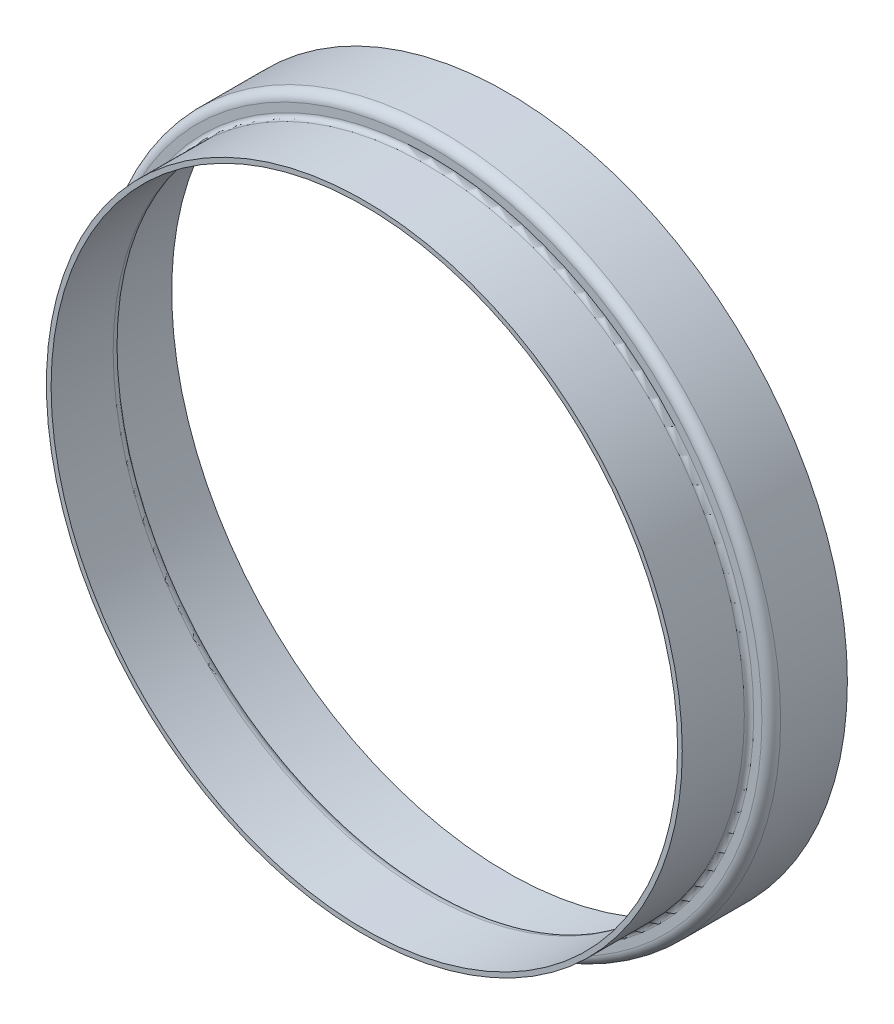
ISO-10303-21;
HEADER;
FILE_DESCRIPTION(('STEP AP214'),'2;1');
FILE_NAME('part.step','',(''),(''),'','','');
FILE_SCHEMA(('AUTOMOTIVE_DESIGN { 1 0 10303 214 1 1 1 1 }'));
ENDSEC;
DATA;
#1=APPLICATION_CONTEXT('core data for automotive mechanical design processes');
#2=APPLICATION_PROTOCOL_DEFINITION('international standard','automotive_design',2000,#1);
#3=PRODUCT_CONTEXT('',#1,'mechanical');
#4=PRODUCT('Part','Part','',(#3));
#5=PRODUCT_RELATED_PRODUCT_CATEGORY('part','',(#4));
#6=PRODUCT_DEFINITION_FORMATION('','',#4);
#7=PRODUCT_DEFINITION_CONTEXT('part definition',#1,'design');
#8=PRODUCT_DEFINITION('design','',#6,#7);
#9=PRODUCT_DEFINITION_SHAPE('','',#8);
#10=(LENGTH_UNIT() NAMED_UNIT(*) SI_UNIT(.MILLI.,.METRE.));
#11=(NAMED_UNIT(*) PLANE_ANGLE_UNIT() SI_UNIT($,.RADIAN.));
#12=(NAMED_UNIT(*) SI_UNIT($,.STERADIAN.) SOLID_ANGLE_UNIT());
#13=UNCERTAINTY_MEASURE_WITH_UNIT(LENGTH_MEASURE(1.E-05),#10,'distance_accuracy_value','');
#14=(GEOMETRIC_REPRESENTATION_CONTEXT(3) GLOBAL_UNCERTAINTY_ASSIGNED_CONTEXT((#13)) GLOBAL_UNIT_ASSIGNED_CONTEXT((#10,
#11,#12)) REPRESENTATION_CONTEXT('',''));
#15=CARTESIAN_POINT('',(0.,0.,0.));
#16=DIRECTION('',(0.,0.,1.));
#17=DIRECTION('',(1.,0.,0.));
#18=AXIS2_PLACEMENT_3D('',#15,#16,#17);
#19=CARTESIAN_POINT('',(0.,0.,0.));
#20=DIRECTION('',(0.,0.,1.));
#21=DIRECTION('',(1.,0.,0.));
#22=AXIS2_PLACEMENT_3D('',#19,#20,#21);
#23=CYLINDRICAL_SURFACE('',#22,33.9725);
#24=CARTESIAN_POINT('',(0.,0.,-6.731));
#25=DIRECTION('',(0.,0.,1.));
#26=DIRECTION('',(1.,0.,0.));
#27=AXIS2_PLACEMENT_3D('',#24,#25,#26);
#28=CIRCLE('',#27,33.9725);
#29=CARTESIAN_POINT('',(33.9725,0.,-6.731));
#30=VERTEX_POINT('',#29);
#31=EDGE_CURVE('E248',#30,#30,#28,.T.);
#32=ORIENTED_EDGE('',*,*,#31,.F.);
#33=EDGE_LOOP('',(#32));
#34=FACE_BOUND('',#33,.T.);
#35=CARTESIAN_POINT('',(0.,0.,0.));
#36=DIRECTION('',(0.,0.,1.));
#37=DIRECTION('',(1.,0.,0.));
#38=AXIS2_PLACEMENT_3D('',#35,#36,#37);
#39=CIRCLE('',#38,33.9725);
#40=CARTESIAN_POINT('',(33.9725,0.,0.));
#41=VERTEX_POINT('',#40);
#42=EDGE_CURVE('E63',#41,#41,#39,.T.);
#43=ORIENTED_EDGE('',*,*,#42,.T.);
#44=EDGE_LOOP('',(#43));
#45=FACE_BOUND('',#44,.T.);
#46=ADVANCED_FACE('F16',(#34,#45),#23,.F.);
#47=CARTESIAN_POINT('',(0.,0.,-6.731));
#48=DIRECTION('',(0.,0.,1.));
#49=DIRECTION('',(1.,0.,0.));
#50=AXIS2_PLACEMENT_3D('',#47,#48,#49);
#51=TOROIDAL_SURFACE('',#50,34.9885,1.016);
#52=CARTESIAN_POINT('',(0.,0.,-7.747));
#53=DIRECTION('',(0.,0.,-1.));
#54=DIRECTION('',(1.,0.,0.));
#55=AXIS2_PLACEMENT_3D('',#52,#53,#54);
#56=CIRCLE('',#55,34.9885);
#57=CARTESIAN_POINT('',(34.9885,0.,-7.747));
#58=VERTEX_POINT('',#57);
#59=CARTESIAN_POINT('',(-34.9885,0.,-7.747));
#60=VERTEX_POINT('',#59);
#61=EDGE_CURVE('E58',#58,#60,#56,.T.);
#62=ORIENTED_EDGE('',*,*,#61,.T.);
#63=CARTESIAN_POINT('',(0.,0.,-7.747));
#64=DIRECTION('',(0.,0.,-1.));
#65=DIRECTION('',(-1.,0.,0.));
#66=AXIS2_PLACEMENT_3D('',#63,#64,#65);
#67=CIRCLE('',#66,34.9885);
#68=EDGE_CURVE('E55',#60,#58,#67,.T.);
#69=ORIENTED_EDGE('',*,*,#68,.T.);
#70=EDGE_LOOP('',(#62,#69));
#71=FACE_BOUND('',#70,.T.);
#72=ORIENTED_EDGE('',*,*,#31,.T.);
#73=EDGE_LOOP('',(#72));
#74=FACE_BOUND('',#73,.T.);
#75=ADVANCED_FACE('F59',(#71,#74),#51,.T.);
#76=CARTESIAN_POINT('',(34.4805,0.,0.));
#77=DIRECTION('',(0.,0.,-1.));
#78=DIRECTION('',(-1.,0.,0.));
#79=AXIS2_PLACEMENT_3D('',#76,#77,#78);
#80=PLANE('',#79);
#81=CARTESIAN_POINT('',(0.,0.,0.));
#82=DIRECTION('',(0.,0.,1.));
#83=DIRECTION('',(1.,0.,0.));
#84=AXIS2_PLACEMENT_3D('',#81,#82,#83);
#85=CIRCLE('',#84,34.4805);
#86=CARTESIAN_POINT('',(34.4805,0.,0.));
#87=VERTEX_POINT('',#86);
#88=EDGE_CURVE('E68',#87,#87,#85,.F.);
#89=ORIENTED_EDGE('',*,*,#88,.F.);
#90=EDGE_LOOP('',(#89));
#91=FACE_BOUND('',#90,.T.);
#92=ORIENTED_EDGE('',*,*,#42,.F.);
#93=EDGE_LOOP('',(#92));
#94=FACE_BOUND('',#93,.T.);
#95=ADVANCED_FACE('F89',(#91,#94),#80,.F.);
#96=CARTESIAN_POINT('',(34.9885,0.,-7.747));
#97=DIRECTION('',(0.,0.,1.));
#98=DIRECTION('',(1.,0.,0.));
#99=AXIS2_PLACEMENT_3D('',#96,#97,#98);
#100=PLANE('',#99);
#101=ORIENTED_EDGE('',*,*,#61,.F.);
#102=ORIENTED_EDGE('',*,*,#68,.F.);
#103=EDGE_LOOP('',(#101,#102));
#104=FACE_BOUND('',#103,.T.);
#105=CARTESIAN_POINT('',(0.,0.,-7.747));
#106=DIRECTION('',(0.,0.,1.));
#107=DIRECTION('',(-1.,0.,0.));
#108=AXIS2_PLACEMENT_3D('',#105,#106,#107);
#109=CIRCLE('',#108,35.8775);
#110=CARTESIAN_POINT('',(35.8775,0.,-7.747));
#111=VERTEX_POINT('',#110);
#112=CARTESIAN_POINT('',(-35.8775,0.,-7.747));
#113=VERTEX_POINT('',#112);
#114=EDGE_CURVE('E109',#111,#113,#109,.F.);
#115=ORIENTED_EDGE('',*,*,#114,.T.);
#116=CARTESIAN_POINT('',(0.,0.,-7.747));
#117=DIRECTION('',(0.,0.,1.));
#118=DIRECTION('',(1.,0.,0.));
#119=AXIS2_PLACEMENT_3D('',#116,#117,#118);
#120=CIRCLE('',#119,35.8775);
#121=EDGE_CURVE('E108',#113,#111,#120,.F.);
#122=ORIENTED_EDGE('',*,*,#121,.T.);
#123=EDGE_LOOP('',(#115,#122));
#124=FACE_BOUND('',#123,.T.);
#125=ADVANCED_FACE('F66',(#104,#124),#100,.F.);
#126=CARTESIAN_POINT('',(0.,0.,0.));
#127=DIRECTION('',(0.,0.,1.));
#128=DIRECTION('',(1.,0.,0.));
#129=AXIS2_PLACEMENT_3D('',#126,#127,#128);
#130=CYLINDRICAL_SURFACE('',#129,34.4805);
#131=CARTESIAN_POINT('',(0.,0.,-6.731));
#132=DIRECTION('',(0.,0.,1.));
#133=DIRECTION('',(1.,0.,0.));
#134=AXIS2_PLACEMENT_3D('',#131,#132,#133);
#135=CIRCLE('',#134,34.4805);
#136=CARTESIAN_POINT('',(34.4805,0.,-6.731));
#137=VERTEX_POINT('',#136);
#138=EDGE_CURVE('E114',#137,#137,#135,.T.);
#139=ORIENTED_EDGE('',*,*,#138,.T.);
#140=EDGE_LOOP('',(#139));
#141=FACE_BOUND('',#140,.T.);
#142=ORIENTED_EDGE('',*,*,#88,.T.);
#143=EDGE_LOOP('',(#142));
#144=FACE_BOUND('',#143,.T.);
#145=ADVANCED_FACE('F88',(#141,#144),#130,.T.);
#146=CARTESIAN_POINT('',(0.,0.,-8.255));
#147=DIRECTION('',(0.,0.,1.));
#148=DIRECTION('',(1.,0.,0.));
#149=AXIS2_PLACEMENT_3D('',#146,#147,#148);
#150=TOROIDAL_SURFACE('',#149,35.8775,0.508000000000002);
#151=ORIENTED_EDGE('',*,*,#114,.F.);
#152=ORIENTED_EDGE('',*,*,#121,.F.);
#153=EDGE_LOOP('',(#151,#152));
#154=FACE_BOUND('',#153,.T.);
#155=CARTESIAN_POINT('',(0.,0.,-8.255));
#156=DIRECTION('',(0.,0.,1.));
#157=DIRECTION('',(1.,0.,0.));
#158=AXIS2_PLACEMENT_3D('',#155,#156,#157);
#159=CIRCLE('',#158,36.3855);
#160=CARTESIAN_POINT('',(36.3855,0.,-8.255));
#161=VERTEX_POINT('',#160);
#162=EDGE_CURVE('E116',#161,#161,#159,.F.);
#163=ORIENTED_EDGE('',*,*,#162,.T.);
#164=EDGE_LOOP('',(#163));
#165=FACE_BOUND('',#164,.T.);
#166=ADVANCED_FACE('F112',(#154,#165),#150,.F.);
#167=CARTESIAN_POINT('',(0.,0.,-6.731));
#168=DIRECTION('',(0.,0.,1.));
#169=DIRECTION('',(1.,0.,0.));
#170=AXIS2_PLACEMENT_3D('',#167,#168,#169);
#171=TOROIDAL_SURFACE('',#170,34.9885,0.508000000000001);
#172=CARTESIAN_POINT('',(0.,0.,-7.239));
#173=DIRECTION('',(0.,0.,1.));
#174=DIRECTION('',(-1.,0.,0.));
#175=AXIS2_PLACEMENT_3D('',#172,#173,#174);
#176=CIRCLE('',#175,34.9885);
#177=CARTESIAN_POINT('',(34.9885,0.,-7.239));
#178=VERTEX_POINT('',#177);
#179=CARTESIAN_POINT('',(-34.9885,0.,-7.239));
#180=VERTEX_POINT('',#179);
#181=EDGE_CURVE('E212',#178,#180,#176,.F.);
#182=ORIENTED_EDGE('',*,*,#181,.F.);
#183=CARTESIAN_POINT('',(0.,0.,-7.239));
#184=DIRECTION('',(0.,0.,1.));
#185=DIRECTION('',(1.,0.,0.));
#186=AXIS2_PLACEMENT_3D('',#183,#184,#185);
#187=CIRCLE('',#186,34.9885);
#188=EDGE_CURVE('E121',#180,#178,#187,.F.);
#189=ORIENTED_EDGE('',*,*,#188,.F.);
#190=EDGE_LOOP('',(#182,#189));
#191=FACE_BOUND('',#190,.T.);
#192=ORIENTED_EDGE('',*,*,#138,.F.);
#193=EDGE_LOOP('',(#192));
#194=FACE_BOUND('',#193,.T.);
#195=ADVANCED_FACE('F129',(#191,#194),#171,.F.);
#196=CARTESIAN_POINT('',(0.,0.,0.));
#197=DIRECTION('',(0.,0.,1.));
#198=DIRECTION('',(1.,0.,0.));
#199=AXIS2_PLACEMENT_3D('',#196,#197,#198);
#200=CYLINDRICAL_SURFACE('',#199,36.3855);
#201=ORIENTED_EDGE('',*,*,#162,.F.);
#202=EDGE_LOOP('',(#201));
#203=FACE_BOUND('',#202,.T.);
#204=CARTESIAN_POINT('',(0.,0.,-15.494));
#205=DIRECTION('',(0.,0.,1.));
#206=DIRECTION('',(1.,0.,0.));
#207=AXIS2_PLACEMENT_3D('',#204,#205,#206);
#208=CIRCLE('',#207,36.3855);
#209=CARTESIAN_POINT('',(36.3855,0.,-15.494));
#210=VERTEX_POINT('',#209);
#211=EDGE_CURVE('E238',#210,#210,#208,.T.);
#212=ORIENTED_EDGE('',*,*,#211,.F.);
#213=EDGE_LOOP('',(#212));
#214=FACE_BOUND('',#213,.T.);
#215=ADVANCED_FACE('F194',(#203,#214),#200,.F.);
#216=CARTESIAN_POINT('',(34.9885,0.,-7.239));
#217=DIRECTION('',(0.,0.,1.));
#218=DIRECTION('',(1.,0.,0.));
#219=AXIS2_PLACEMENT_3D('',#216,#217,#218);
#220=PLANE('',#219);
#221=ORIENTED_EDGE('',*,*,#188,.T.);
#222=ORIENTED_EDGE('',*,*,#181,.T.);
#223=EDGE_LOOP('',(#221,#222));
#224=FACE_BOUND('',#223,.T.);
#225=CARTESIAN_POINT('',(0.,0.,-7.239));
#226=DIRECTION('',(0.,0.,-1.));
#227=DIRECTION('',(-1.,0.,0.));
#228=AXIS2_PLACEMENT_3D('',#225,#226,#227);
#229=CIRCLE('',#228,35.8775);
#230=CARTESIAN_POINT('',(-35.8775,0.,-7.239));
#231=VERTEX_POINT('',#230);
#232=CARTESIAN_POINT('',(35.8775,0.,-7.239));
#233=VERTEX_POINT('',#232);
#234=EDGE_CURVE('E182',#231,#233,#229,.T.);
#235=ORIENTED_EDGE('',*,*,#234,.F.);
#236=CARTESIAN_POINT('',(0.,0.,-7.239));
#237=DIRECTION('',(0.,0.,-1.));
#238=DIRECTION('',(1.,0.,0.));
#239=AXIS2_PLACEMENT_3D('',#236,#237,#238);
#240=CIRCLE('',#239,35.8775);
#241=EDGE_CURVE('E34',#233,#231,#240,.T.);
#242=ORIENTED_EDGE('',*,*,#241,.F.);
#243=EDGE_LOOP('',(#235,#242));
#244=FACE_BOUND('',#243,.T.);
#245=ADVANCED_FACE('F186',(#224,#244),#220,.T.);
#246=CARTESIAN_POINT('',(-37.592,0.,-15.494));
#247=DIRECTION('',(0.,0.,-1.));
#248=DIRECTION('',(-1.,0.,0.));
#249=AXIS2_PLACEMENT_3D('',#246,#247,#248);
#250=PLANE('',#249);
#251=ORIENTED_EDGE('',*,*,#211,.T.);
#252=EDGE_LOOP('',(#251));
#253=FACE_BOUND('',#252,.T.);
#254=CARTESIAN_POINT('',(0.,0.,-15.494));
#255=DIRECTION('',(0.,0.,1.));
#256=DIRECTION('',(1.,0.,0.));
#257=AXIS2_PLACEMENT_3D('',#254,#255,#256);
#258=CIRCLE('',#257,36.8935);
#259=CARTESIAN_POINT('',(36.8935,0.,-15.494));
#260=VERTEX_POINT('',#259);
#261=EDGE_CURVE('E26',#260,#260,#258,.T.);
#262=ORIENTED_EDGE('',*,*,#261,.F.);
#263=EDGE_LOOP('',(#262));
#264=FACE_BOUND('',#263,.T.);
#265=ADVANCED_FACE('F174',(#253,#264),#250,.T.);
#266=CARTESIAN_POINT('',(0.,0.,-8.255));
#267=DIRECTION('',(0.,0.,1.));
#268=DIRECTION('',(1.,0.,0.));
#269=AXIS2_PLACEMENT_3D('',#266,#267,#268);
#270=TOROIDAL_SURFACE('',#269,35.8775,1.016);
#271=ORIENTED_EDGE('',*,*,#241,.T.);
#272=ORIENTED_EDGE('',*,*,#234,.T.);
#273=EDGE_LOOP('',(#271,#272));
#274=FACE_BOUND('',#273,.T.);
#275=CARTESIAN_POINT('',(0.,0.,-8.255));
#276=DIRECTION('',(0.,0.,1.));
#277=DIRECTION('',(1.,0.,0.));
#278=AXIS2_PLACEMENT_3D('',#275,#276,#277);
#279=CIRCLE('',#278,36.8935);
#280=CARTESIAN_POINT('',(36.8935,0.,-8.255));
#281=VERTEX_POINT('',#280);
#282=EDGE_CURVE('E11',#281,#281,#279,.F.);
#283=ORIENTED_EDGE('',*,*,#282,.F.);
#284=EDGE_LOOP('',(#283));
#285=FACE_BOUND('',#284,.T.);
#286=ADVANCED_FACE('F162',(#274,#285),#270,.T.);
#287=CARTESIAN_POINT('',(0.,0.,0.));
#288=DIRECTION('',(0.,0.,1.));
#289=DIRECTION('',(1.,0.,0.));
#290=AXIS2_PLACEMENT_3D('',#287,#288,#289);
#291=CYLINDRICAL_SURFACE('',#290,36.8935);
#292=ORIENTED_EDGE('',*,*,#282,.T.);
#293=EDGE_LOOP('',(#292));
#294=FACE_BOUND('',#293,.T.);
#295=ORIENTED_EDGE('',*,*,#261,.T.);
#296=EDGE_LOOP('',(#295));
#297=FACE_BOUND('',#296,.T.);
#298=ADVANCED_FACE('F173',(#294,#297),#291,.T.);
#299=CLOSED_SHELL('',(#46,#75,#95,#125,#145,#166,#195,#215,#245,#265,#286,#298));
#300=MANIFOLD_SOLID_BREP('B1',#299);
#301=ADVANCED_BREP_SHAPE_REPRESENTATION('',(#18,#300),#14);
#302=SHAPE_DEFINITION_REPRESENTATION(#9,#301);
ENDSEC;
END-ISO-10303-21;
